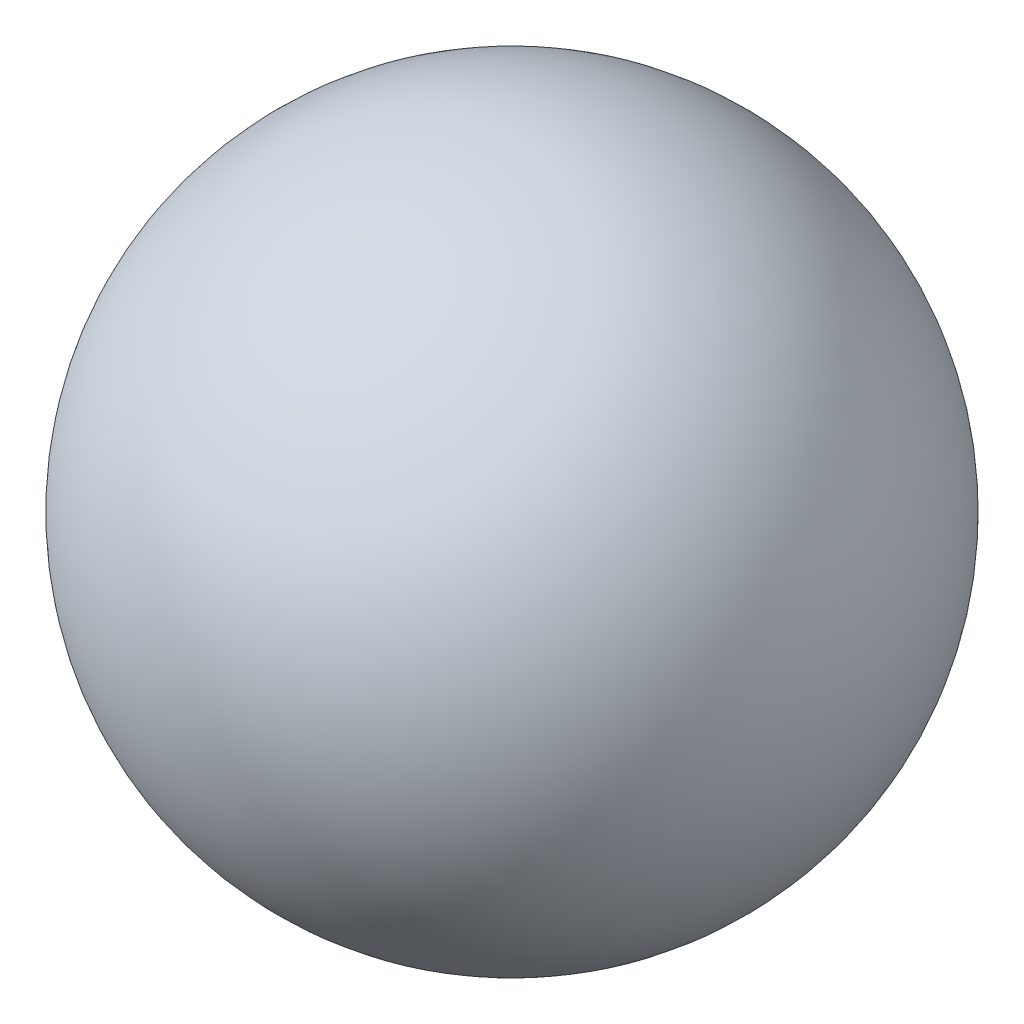
ISO-10303-21;
HEADER;
FILE_DESCRIPTION(('STEP AP214'),'2;1');
FILE_NAME('part.step','',(''),(''),'','','');
FILE_SCHEMA(('AUTOMOTIVE_DESIGN { 1 0 10303 214 1 1 1 1 }'));
ENDSEC;
DATA;
#1=APPLICATION_CONTEXT('core data for automotive mechanical design processes');
#2=APPLICATION_PROTOCOL_DEFINITION('international standard','automotive_design',2000,#1);
#3=PRODUCT_CONTEXT('',#1,'mechanical');
#4=PRODUCT('Part','Part','',(#3));
#5=PRODUCT_RELATED_PRODUCT_CATEGORY('part','',(#4));
#6=PRODUCT_DEFINITION_FORMATION('','',#4);
#7=PRODUCT_DEFINITION_CONTEXT('part definition',#1,'design');
#8=PRODUCT_DEFINITION('design','',#6,#7);
#9=PRODUCT_DEFINITION_SHAPE('','',#8);
#10=(LENGTH_UNIT() NAMED_UNIT(*) SI_UNIT(.MILLI.,.METRE.));
#11=(NAMED_UNIT(*) PLANE_ANGLE_UNIT() SI_UNIT($,.RADIAN.));
#12=(NAMED_UNIT(*) SI_UNIT($,.STERADIAN.) SOLID_ANGLE_UNIT());
#13=UNCERTAINTY_MEASURE_WITH_UNIT(LENGTH_MEASURE(1.E-05),#10,'distance_accuracy_value','');
#14=(GEOMETRIC_REPRESENTATION_CONTEXT(3) GLOBAL_UNCERTAINTY_ASSIGNED_CONTEXT((#13)) GLOBAL_UNIT_ASSIGNED_CONTEXT((#10,
#11,#12)) REPRESENTATION_CONTEXT('',''));
#15=CARTESIAN_POINT('',(0.,0.,0.));
#16=DIRECTION('',(0.,0.,1.));
#17=DIRECTION('',(1.,0.,0.));
#18=AXIS2_PLACEMENT_3D('',#15,#16,#17);
#19=CARTESIAN_POINT('',(0.,0.,0.));
#20=DIRECTION('',(0.,-1.,0.));
#21=DIRECTION('',(-1.,0.,0.));
#22=AXIS2_PLACEMENT_3D('',#19,#20,#21);
#23=SPHERICAL_SURFACE('',#22,165.1);
#24=CARTESIAN_POINT('',(0.,-165.1,0.));
#25=VERTEX_POINT('',#24);
#26=VERTEX_LOOP('',#25);
#27=FACE_BOUND('',#26,.T.);
#28=ADVANCED_FACE('F29',(#27),#23,.T.);
#29=CLOSED_SHELL('',(#28));
#30=MANIFOLD_SOLID_BREP('B2',#29);
#31=ADVANCED_BREP_SHAPE_REPRESENTATION('',(#18,#30),#14);
#32=SHAPE_DEFINITION_REPRESENTATION(#9,#31);
ENDSEC;
END-ISO-10303-21;
